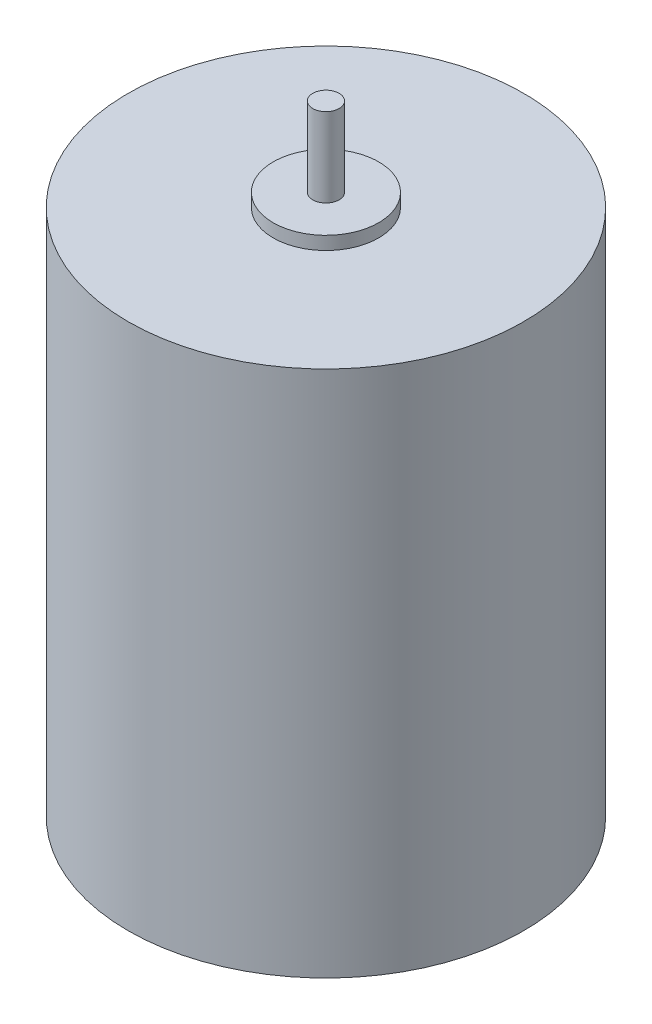
ISO-10303-21;
HEADER;
FILE_DESCRIPTION(('STEP AP214'),'2;1');
FILE_NAME('part.step','',(''),(''),'','','');
FILE_SCHEMA(('AUTOMOTIVE_DESIGN { 1 0 10303 214 1 1 1 1 }'));
ENDSEC;
DATA;
#1=APPLICATION_CONTEXT('core data for automotive mechanical design processes');
#2=APPLICATION_PROTOCOL_DEFINITION('international standard','automotive_design',2000,#1);
#3=PRODUCT_CONTEXT('',#1,'mechanical');
#4=PRODUCT('Part','Part','',(#3));
#5=PRODUCT_RELATED_PRODUCT_CATEGORY('part','',(#4));
#6=PRODUCT_DEFINITION_FORMATION('','',#4);
#7=PRODUCT_DEFINITION_CONTEXT('part definition',#1,'design');
#8=PRODUCT_DEFINITION('design','',#6,#7);
#9=PRODUCT_DEFINITION_SHAPE('','',#8);
#10=(LENGTH_UNIT() NAMED_UNIT(*) SI_UNIT(.MILLI.,.METRE.));
#11=(NAMED_UNIT(*) PLANE_ANGLE_UNIT() SI_UNIT($,.RADIAN.));
#12=(NAMED_UNIT(*) SI_UNIT($,.STERADIAN.) SOLID_ANGLE_UNIT());
#13=UNCERTAINTY_MEASURE_WITH_UNIT(LENGTH_MEASURE(1.E-05),#10,'distance_accuracy_value','');
#14=(GEOMETRIC_REPRESENTATION_CONTEXT(3) GLOBAL_UNCERTAINTY_ASSIGNED_CONTEXT((#13)) GLOBAL_UNIT_ASSIGNED_CONTEXT((#10,
#11,#12)) REPRESENTATION_CONTEXT('',''));
#15=CARTESIAN_POINT('',(0.,0.,0.));
#16=DIRECTION('',(0.,0.,1.));
#17=DIRECTION('',(1.,0.,0.));
#18=AXIS2_PLACEMENT_3D('',#15,#16,#17);
#19=CARTESIAN_POINT('',(0.,41.,0.));
#20=DIRECTION('',(0.,1.,0.));
#21=DIRECTION('',(0.,0.,1.));
#22=AXIS2_PLACEMENT_3D('',#19,#20,#21);
#23=PLANE('',#22);
#24=CARTESIAN_POINT('',(0.,41.,0.));
#25=DIRECTION('',(0.,1.,0.));
#26=DIRECTION('',(0.,0.,1.));
#27=AXIS2_PLACEMENT_3D('',#24,#25,#26);
#28=CIRCLE('',#27,4.);
#29=CARTESIAN_POINT('',(0.,41.,4.));
#30=VERTEX_POINT('',#29);
#31=EDGE_CURVE('E40',#30,#30,#28,.T.);
#32=ORIENTED_EDGE('',*,*,#31,.T.);
#33=EDGE_LOOP('',(#32));
#34=FACE_BOUND('',#33,.T.);
#35=CARTESIAN_POINT('',(0.,41.,0.));
#36=DIRECTION('',(0.,1.,0.));
#37=DIRECTION('',(0.,0.,1.));
#38=AXIS2_PLACEMENT_3D('',#35,#36,#37);
#39=CIRCLE('',#38,1.);
#40=CARTESIAN_POINT('',(0.,41.,1.));
#41=VERTEX_POINT('',#40);
#42=EDGE_CURVE('E48',#41,#41,#39,.T.);
#43=ORIENTED_EDGE('',*,*,#42,.F.);
#44=EDGE_LOOP('',(#43));
#45=FACE_BOUND('',#44,.T.);
#46=ADVANCED_FACE('F29',(#34,#45),#23,.T.);
#47=CARTESIAN_POINT('',(0.,40.,0.));
#48=DIRECTION('',(0.,1.,0.));
#49=DIRECTION('',(0.,0.,1.));
#50=AXIS2_PLACEMENT_3D('',#47,#48,#49);
#51=PLANE('',#50);
#52=CARTESIAN_POINT('',(0.,40.,0.));
#53=DIRECTION('',(0.,1.,0.));
#54=DIRECTION('',(0.,0.,1.));
#55=AXIS2_PLACEMENT_3D('',#52,#53,#54);
#56=CIRCLE('',#55,15.);
#57=CARTESIAN_POINT('',(0.,40.,15.));
#58=VERTEX_POINT('',#57);
#59=EDGE_CURVE('E10',#58,#58,#56,.T.);
#60=ORIENTED_EDGE('',*,*,#59,.T.);
#61=EDGE_LOOP('',(#60));
#62=FACE_BOUND('',#61,.T.);
#63=CARTESIAN_POINT('',(0.,40.,0.));
#64=DIRECTION('',(0.,1.,0.));
#65=DIRECTION('',(0.,0.,1.));
#66=AXIS2_PLACEMENT_3D('',#63,#64,#65);
#67=CIRCLE('',#66,4.);
#68=CARTESIAN_POINT('',(0.,40.,4.));
#69=VERTEX_POINT('',#68);
#70=EDGE_CURVE('E42',#69,#69,#67,.T.);
#71=ORIENTED_EDGE('',*,*,#70,.F.);
#72=EDGE_LOOP('',(#71));
#73=FACE_BOUND('',#72,.T.);
#74=ADVANCED_FACE('F64',(#62,#73),#51,.T.);
#75=CARTESIAN_POINT('',(0.,40.,0.));
#76=DIRECTION('',(0.,-1.,0.));
#77=DIRECTION('',(0.,0.,-1.));
#78=AXIS2_PLACEMENT_3D('',#75,#76,#77);
#79=CYLINDRICAL_SURFACE('',#78,15.);
#80=ORIENTED_EDGE('',*,*,#59,.F.);
#81=EDGE_LOOP('',(#80));
#82=FACE_BOUND('',#81,.T.);
#83=CARTESIAN_POINT('',(0.,0.,0.));
#84=DIRECTION('',(0.,1.,0.));
#85=DIRECTION('',(0.,0.,1.));
#86=AXIS2_PLACEMENT_3D('',#83,#84,#85);
#87=CIRCLE('',#86,15.);
#88=CARTESIAN_POINT('',(0.,0.,15.));
#89=VERTEX_POINT('',#88);
#90=EDGE_CURVE('E33',#89,#89,#87,.T.);
#91=ORIENTED_EDGE('',*,*,#90,.T.);
#92=EDGE_LOOP('',(#91));
#93=FACE_BOUND('',#92,.T.);
#94=ADVANCED_FACE('F31',(#82,#93),#79,.T.);
#95=CARTESIAN_POINT('',(0.,0.,0.));
#96=DIRECTION('',(0.,1.,0.));
#97=DIRECTION('',(0.,0.,1.));
#98=AXIS2_PLACEMENT_3D('',#95,#96,#97);
#99=PLANE('',#98);
#100=ORIENTED_EDGE('',*,*,#90,.F.);
#101=EDGE_LOOP('',(#100));
#102=FACE_BOUND('',#101,.T.);
#103=ADVANCED_FACE('F74',(#102),#99,.F.);
#104=CARTESIAN_POINT('',(0.,41.,0.));
#105=DIRECTION('',(0.,-1.,0.));
#106=DIRECTION('',(0.,0.,-1.));
#107=AXIS2_PLACEMENT_3D('',#104,#105,#106);
#108=CYLINDRICAL_SURFACE('',#107,4.);
#109=ORIENTED_EDGE('',*,*,#31,.F.);
#110=EDGE_LOOP('',(#109));
#111=FACE_BOUND('',#110,.T.);
#112=ORIENTED_EDGE('',*,*,#70,.T.);
#113=EDGE_LOOP('',(#112));
#114=FACE_BOUND('',#113,.T.);
#115=ADVANCED_FACE('F59',(#111,#114),#108,.T.);
#116=CARTESIAN_POINT('',(0.,47.,0.));
#117=DIRECTION('',(0.,-1.,0.));
#118=DIRECTION('',(0.,0.,-1.));
#119=AXIS2_PLACEMENT_3D('',#116,#117,#118);
#120=CYLINDRICAL_SURFACE('',#119,1.);
#121=CARTESIAN_POINT('',(0.,47.,0.));
#122=DIRECTION('',(0.,1.,0.));
#123=DIRECTION('',(0.,0.,1.));
#124=AXIS2_PLACEMENT_3D('',#121,#122,#123);
#125=CIRCLE('',#124,1.);
#126=CARTESIAN_POINT('',(0.,47.,1.));
#127=VERTEX_POINT('',#126);
#128=EDGE_CURVE('E45',#127,#127,#125,.T.);
#129=ORIENTED_EDGE('',*,*,#128,.F.);
#130=EDGE_LOOP('',(#129));
#131=FACE_BOUND('',#130,.T.);
#132=ORIENTED_EDGE('',*,*,#42,.T.);
#133=EDGE_LOOP('',(#132));
#134=FACE_BOUND('',#133,.T.);
#135=ADVANCED_FACE('F56',(#131,#134),#120,.T.);
#136=CARTESIAN_POINT('',(0.,47.,0.));
#137=DIRECTION('',(0.,1.,0.));
#138=DIRECTION('',(0.,0.,1.));
#139=AXIS2_PLACEMENT_3D('',#136,#137,#138);
#140=PLANE('',#139);
#141=ORIENTED_EDGE('',*,*,#128,.T.);
#142=EDGE_LOOP('',(#141));
#143=FACE_BOUND('',#142,.T.);
#144=ADVANCED_FACE('F54',(#143),#140,.T.);
#145=CLOSED_SHELL('',(#46,#74,#94,#103,#115,#135,#144));
#146=MANIFOLD_SOLID_BREP('B2',#145);
#147=ADVANCED_BREP_SHAPE_REPRESENTATION('',(#18,#146),#14);
#148=SHAPE_DEFINITION_REPRESENTATION(#9,#147);
ENDSEC;
END-ISO-10303-21;
